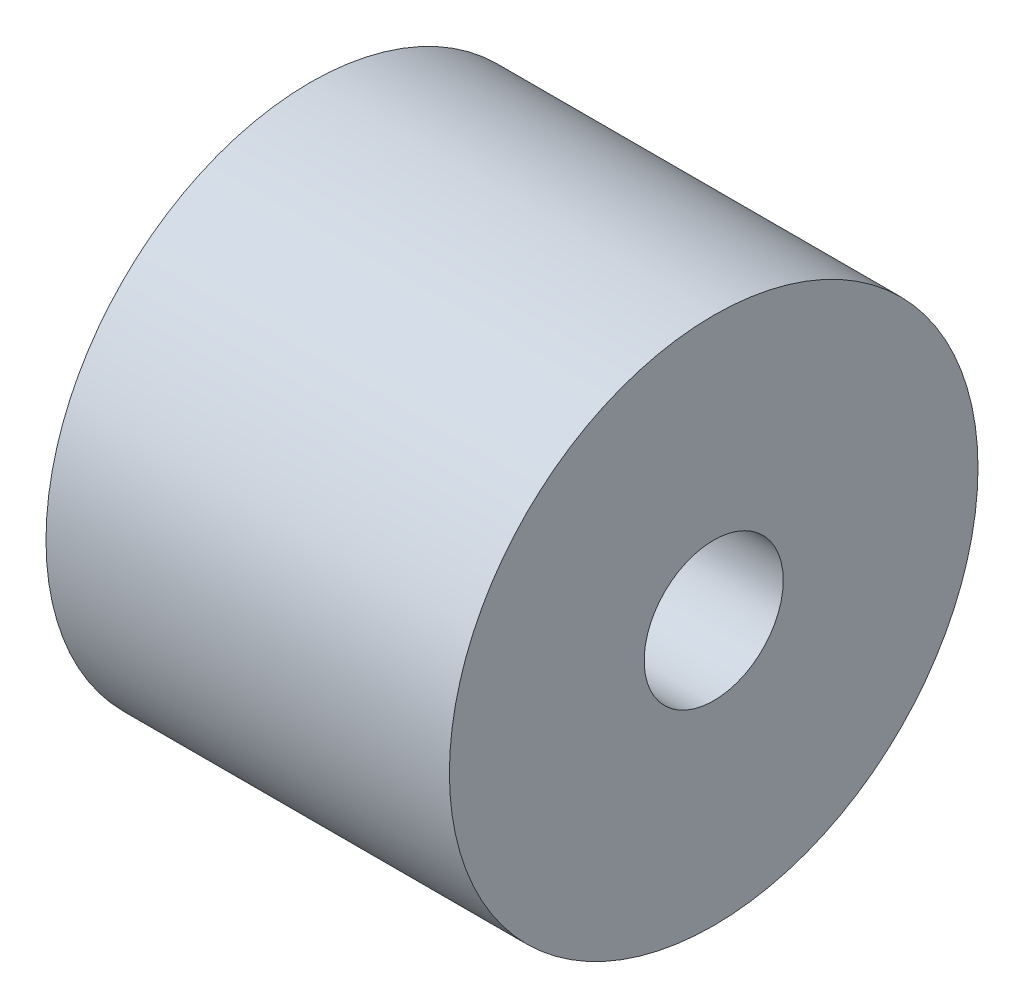
ISO-10303-21;
HEADER;
FILE_DESCRIPTION(('STEP AP214'),'2;1');
FILE_NAME('part.step','',(''),(''),'','','');
FILE_SCHEMA(('AUTOMOTIVE_DESIGN { 1 0 10303 214 1 1 1 1 }'));
ENDSEC;
DATA;
#1=APPLICATION_CONTEXT('core data for automotive mechanical design processes');
#2=APPLICATION_PROTOCOL_DEFINITION('international standard','automotive_design',2000,#1);
#3=PRODUCT_CONTEXT('',#1,'mechanical');
#4=PRODUCT('Part','Part','',(#3));
#5=PRODUCT_RELATED_PRODUCT_CATEGORY('part','',(#4));
#6=PRODUCT_DEFINITION_FORMATION('','',#4);
#7=PRODUCT_DEFINITION_CONTEXT('part definition',#1,'design');
#8=PRODUCT_DEFINITION('design','',#6,#7);
#9=PRODUCT_DEFINITION_SHAPE('','',#8);
#10=(LENGTH_UNIT() NAMED_UNIT(*) SI_UNIT(.MILLI.,.METRE.));
#11=(NAMED_UNIT(*) PLANE_ANGLE_UNIT() SI_UNIT($,.RADIAN.));
#12=(NAMED_UNIT(*) SI_UNIT($,.STERADIAN.) SOLID_ANGLE_UNIT());
#13=UNCERTAINTY_MEASURE_WITH_UNIT(LENGTH_MEASURE(1.E-05),#10,'distance_accuracy_value','');
#14=(GEOMETRIC_REPRESENTATION_CONTEXT(3) GLOBAL_UNCERTAINTY_ASSIGNED_CONTEXT((#13)) GLOBAL_UNIT_ASSIGNED_CONTEXT((#10,
#11,#12)) REPRESENTATION_CONTEXT('',''));
#15=CARTESIAN_POINT('',(0.,0.,0.));
#16=DIRECTION('',(0.,0.,1.));
#17=DIRECTION('',(1.,0.,0.));
#18=AXIS2_PLACEMENT_3D('',#15,#16,#17);
#19=CARTESIAN_POINT('',(58.,0.,0.));
#20=DIRECTION('',(-1.,0.,0.));
#21=DIRECTION('',(0.,0.,1.));
#22=AXIS2_PLACEMENT_3D('',#19,#20,#21);
#23=CYLINDRICAL_SURFACE('',#22,38.);
#24=CARTESIAN_POINT('',(58.,0.,0.));
#25=DIRECTION('',(1.,0.,0.));
#26=DIRECTION('',(0.,0.,-1.));
#27=AXIS2_PLACEMENT_3D('',#24,#25,#26);
#28=CIRCLE('',#27,38.);
#29=CARTESIAN_POINT('',(58.,0.,-38.));
#30=VERTEX_POINT('',#29);
#31=EDGE_CURVE('E10',#30,#30,#28,.T.);
#32=ORIENTED_EDGE('',*,*,#31,.F.);
#33=EDGE_LOOP('',(#32));
#34=FACE_BOUND('',#33,.T.);
#35=CARTESIAN_POINT('',(0.,0.,0.));
#36=DIRECTION('',(1.,0.,0.));
#37=DIRECTION('',(0.,0.,-1.));
#38=AXIS2_PLACEMENT_3D('',#35,#36,#37);
#39=CIRCLE('',#38,38.);
#40=CARTESIAN_POINT('',(0.,0.,-38.));
#41=VERTEX_POINT('',#40);
#42=EDGE_CURVE('E34',#41,#41,#39,.T.);
#43=ORIENTED_EDGE('',*,*,#42,.T.);
#44=EDGE_LOOP('',(#43));
#45=FACE_BOUND('',#44,.T.);
#46=ADVANCED_FACE('F31',(#34,#45),#23,.T.);
#47=CARTESIAN_POINT('',(58.,0.,0.));
#48=DIRECTION('',(1.,0.,0.));
#49=DIRECTION('',(0.,0.,-1.));
#50=AXIS2_PLACEMENT_3D('',#47,#48,#49);
#51=PLANE('',#50);
#52=CARTESIAN_POINT('',(58.,0.,0.));
#53=DIRECTION('',(1.,0.,0.));
#54=DIRECTION('',(0.,0.,-1.));
#55=AXIS2_PLACEMENT_3D('',#52,#53,#54);
#56=CIRCLE('',#55,10.);
#57=CARTESIAN_POINT('',(58.,0.,-10.));
#58=VERTEX_POINT('',#57);
#59=EDGE_CURVE('E43',#58,#58,#56,.T.);
#60=ORIENTED_EDGE('',*,*,#59,.F.);
#61=EDGE_LOOP('',(#60));
#62=FACE_BOUND('',#61,.T.);
#63=ORIENTED_EDGE('',*,*,#31,.T.);
#64=EDGE_LOOP('',(#63));
#65=FACE_BOUND('',#64,.T.);
#66=ADVANCED_FACE('F58',(#62,#65),#51,.T.);
#67=CARTESIAN_POINT('',(0.,0.,0.));
#68=DIRECTION('',(1.,0.,0.));
#69=DIRECTION('',(0.,0.,-1.));
#70=AXIS2_PLACEMENT_3D('',#67,#68,#69);
#71=PLANE('',#70);
#72=CARTESIAN_POINT('',(0.,0.,0.));
#73=DIRECTION('',(1.,0.,0.));
#74=DIRECTION('',(0.,0.,-1.));
#75=AXIS2_PLACEMENT_3D('',#72,#73,#74);
#76=CIRCLE('',#75,10.);
#77=CARTESIAN_POINT('',(0.,0.,-10.));
#78=VERTEX_POINT('',#77);
#79=EDGE_CURVE('E41',#78,#78,#76,.T.);
#80=ORIENTED_EDGE('',*,*,#79,.T.);
#81=EDGE_LOOP('',(#80));
#82=FACE_BOUND('',#81,.T.);
#83=ORIENTED_EDGE('',*,*,#42,.F.);
#84=EDGE_LOOP('',(#83));
#85=FACE_BOUND('',#84,.T.);
#86=ADVANCED_FACE('F49',(#82,#85),#71,.F.);
#87=CARTESIAN_POINT('',(0.,0.,0.));
#88=DIRECTION('',(1.,0.,0.));
#89=DIRECTION('',(0.,0.,-1.));
#90=AXIS2_PLACEMENT_3D('',#87,#88,#89);
#91=CYLINDRICAL_SURFACE('',#90,10.);
#92=ORIENTED_EDGE('',*,*,#79,.F.);
#93=EDGE_LOOP('',(#92));
#94=FACE_BOUND('',#93,.T.);
#95=ORIENTED_EDGE('',*,*,#59,.T.);
#96=EDGE_LOOP('',(#95));
#97=FACE_BOUND('',#96,.T.);
#98=ADVANCED_FACE('F52',(#94,#97),#91,.F.);
#99=CLOSED_SHELL('',(#46,#66,#86,#98));
#100=MANIFOLD_SOLID_BREP('B2',#99);
#101=ADVANCED_BREP_SHAPE_REPRESENTATION('',(#18,#100),#14);
#102=SHAPE_DEFINITION_REPRESENTATION(#9,#101);
ENDSEC;
END-ISO-10303-21;
